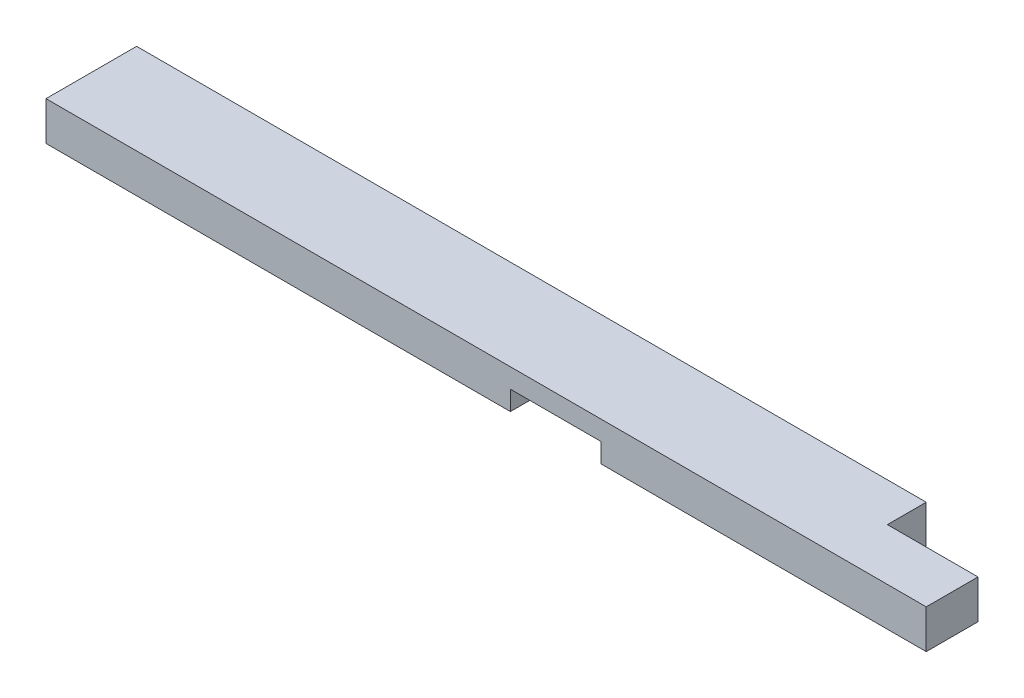
ISO-10303-21;
HEADER;
FILE_DESCRIPTION(('STEP AP214'),'2;1');
FILE_NAME('part.step','',(''),(''),'','','');
FILE_SCHEMA(('AUTOMOTIVE_DESIGN { 1 0 10303 214 1 1 1 1 }'));
ENDSEC;
DATA;
#1=APPLICATION_CONTEXT('core data for automotive mechanical design processes');
#2=APPLICATION_PROTOCOL_DEFINITION('international standard','automotive_design',2000,#1);
#3=PRODUCT_CONTEXT('',#1,'mechanical');
#4=PRODUCT('Part','Part','',(#3));
#5=PRODUCT_RELATED_PRODUCT_CATEGORY('part','',(#4));
#6=PRODUCT_DEFINITION_FORMATION('','',#4);
#7=PRODUCT_DEFINITION_CONTEXT('part definition',#1,'design');
#8=PRODUCT_DEFINITION('design','',#6,#7);
#9=PRODUCT_DEFINITION_SHAPE('','',#8);
#10=(LENGTH_UNIT() NAMED_UNIT(*) SI_UNIT(.MILLI.,.METRE.));
#11=(NAMED_UNIT(*) PLANE_ANGLE_UNIT() SI_UNIT($,.RADIAN.));
#12=(NAMED_UNIT(*) SI_UNIT($,.STERADIAN.) SOLID_ANGLE_UNIT());
#13=UNCERTAINTY_MEASURE_WITH_UNIT(LENGTH_MEASURE(1.E-05),#10,'distance_accuracy_value','');
#14=(GEOMETRIC_REPRESENTATION_CONTEXT(3) GLOBAL_UNCERTAINTY_ASSIGNED_CONTEXT((#13)) GLOBAL_UNIT_ASSIGNED_CONTEXT((#10,
#11,#12)) REPRESENTATION_CONTEXT('',''));
#15=CARTESIAN_POINT('',(0.,0.,0.));
#16=DIRECTION('',(0.,0.,1.));
#17=DIRECTION('',(1.,0.,0.));
#18=AXIS2_PLACEMENT_3D('',#15,#16,#17);
#19=CARTESIAN_POINT('',(0.,0.,0.));
#20=DIRECTION('',(0.,-1.,0.));
#21=DIRECTION('',(0.,0.,-1.));
#22=AXIS2_PLACEMENT_3D('',#19,#20,#21);
#23=PLANE('',#22);
#24=DIRECTION('',(0.,0.,-1.));
#25=VECTOR('',#24,1.);
#26=CARTESIAN_POINT('',(544.5125,0.,0.));
#27=LINE('',#26,#25);
#28=CARTESIAN_POINT('',(544.5125,0.,0.));
#29=VERTEX_POINT('',#28);
#30=CARTESIAN_POINT('',(544.5125,0.,-88.9));
#31=VERTEX_POINT('',#30);
#32=EDGE_CURVE('E115',#29,#31,#27,.T.);
#33=ORIENTED_EDGE('',*,*,#32,.T.);
#34=DIRECTION('',(-1.,0.,0.));
#35=VECTOR('',#34,1.);
#36=CARTESIAN_POINT('',(0.,0.,-88.9));
#37=LINE('',#36,#35);
#38=CARTESIAN_POINT('',(774.7,0.,-88.9));
#39=VERTEX_POINT('',#38);
#40=EDGE_CURVE('E151',#39,#31,#37,.T.);
#41=ORIENTED_EDGE('',*,*,#40,.F.);
#42=DIRECTION('',(0.,0.,1.));
#43=VECTOR('',#42,1.);
#44=CARTESIAN_POINT('',(774.7,0.,-88.9));
#45=LINE('',#44,#43);
#46=CARTESIAN_POINT('',(774.7,0.,-50.8));
#47=VERTEX_POINT('',#46);
#48=EDGE_CURVE('E194',#39,#47,#45,.T.);
#49=ORIENTED_EDGE('',*,*,#48,.T.);
#50=DIRECTION('',(1.,0.,0.));
#51=VECTOR('',#50,1.);
#52=CARTESIAN_POINT('',(863.6,0.,-50.8));
#53=LINE('',#52,#51);
#54=CARTESIAN_POINT('',(863.6,0.,-50.8));
#55=VERTEX_POINT('',#54);
#56=EDGE_CURVE('E61',#47,#55,#53,.T.);
#57=ORIENTED_EDGE('',*,*,#56,.T.);
#58=DIRECTION('',(0.,0.,-1.));
#59=VECTOR('',#58,1.);
#60=CARTESIAN_POINT('',(863.6,0.,0.));
#61=LINE('',#60,#59);
#62=CARTESIAN_POINT('',(863.6,0.,0.));
#63=VERTEX_POINT('',#62);
#64=EDGE_CURVE('E139',#63,#55,#61,.T.);
#65=ORIENTED_EDGE('',*,*,#64,.F.);
#66=DIRECTION('',(1.,0.,0.));
#67=VECTOR('',#66,1.);
#68=CARTESIAN_POINT('',(0.,0.,0.));
#69=LINE('',#68,#67);
#70=EDGE_CURVE('E132',#29,#63,#69,.T.);
#71=ORIENTED_EDGE('',*,*,#70,.F.);
#72=EDGE_LOOP('',(#33,#41,#49,#57,#65,#71));
#73=FACE_BOUND('',#72,.T.);
#74=ADVANCED_FACE('F38',(#73),#23,.T.);
#75=CARTESIAN_POINT('',(0.,38.1,0.));
#76=DIRECTION('',(1.,0.,0.));
#77=DIRECTION('',(0.,0.,-1.));
#78=AXIS2_PLACEMENT_3D('',#75,#76,#77);
#79=PLANE('',#78);
#80=DIRECTION('',(0.,0.,1.));
#81=VECTOR('',#80,1.);
#82=CARTESIAN_POINT('',(0.,0.,0.));
#83=LINE('',#82,#81);
#84=CARTESIAN_POINT('',(0.,0.,-88.9));
#85=VERTEX_POINT('',#84);
#86=CARTESIAN_POINT('',(0.,0.,0.));
#87=VERTEX_POINT('',#86);
#88=EDGE_CURVE('E141',#85,#87,#83,.T.);
#89=ORIENTED_EDGE('',*,*,#88,.T.);
#90=DIRECTION('',(0.,-1.,0.));
#91=VECTOR('',#90,1.);
#92=CARTESIAN_POINT('',(0.,38.1,0.));
#93=LINE('',#92,#91);
#94=CARTESIAN_POINT('',(0.,38.1,0.));
#95=VERTEX_POINT('',#94);
#96=EDGE_CURVE('E11',#95,#87,#93,.T.);
#97=ORIENTED_EDGE('',*,*,#96,.F.);
#98=DIRECTION('',(0.,0.,1.));
#99=VECTOR('',#98,1.);
#100=CARTESIAN_POINT('',(0.,38.1,0.));
#101=LINE('',#100,#99);
#102=CARTESIAN_POINT('',(0.,38.1,-88.9));
#103=VERTEX_POINT('',#102);
#104=EDGE_CURVE('E153',#103,#95,#101,.T.);
#105=ORIENTED_EDGE('',*,*,#104,.F.);
#106=DIRECTION('',(0.,-1.,0.));
#107=VECTOR('',#106,1.);
#108=CARTESIAN_POINT('',(0.,38.1,-88.9));
#109=LINE('',#108,#107);
#110=EDGE_CURVE('E154',#103,#85,#109,.T.);
#111=ORIENTED_EDGE('',*,*,#110,.T.);
#112=EDGE_LOOP('',(#89,#97,#105,#111));
#113=FACE_BOUND('',#112,.T.);
#114=ADVANCED_FACE('F40',(#113),#79,.F.);
#115=CARTESIAN_POINT('',(0.,38.1,0.));
#116=DIRECTION('',(0.,0.,-1.));
#117=DIRECTION('',(-1.,0.,0.));
#118=AXIS2_PLACEMENT_3D('',#115,#116,#117);
#119=PLANE('',#118);
#120=DIRECTION('',(1.,0.,0.));
#121=VECTOR('',#120,1.);
#122=CARTESIAN_POINT('',(544.5125,19.0499999999991,0.));
#123=LINE('',#122,#121);
#124=CARTESIAN_POINT('',(455.6125,19.0499999999991,0.));
#125=VERTEX_POINT('',#124);
#126=CARTESIAN_POINT('',(544.5125,19.0499999999991,0.));
#127=VERTEX_POINT('',#126);
#128=EDGE_CURVE('E127',#125,#127,#123,.T.);
#129=ORIENTED_EDGE('',*,*,#128,.T.);
#130=DIRECTION('',(0.,-1.,0.));
#131=VECTOR('',#130,1.);
#132=CARTESIAN_POINT('',(544.5125,19.0499999999991,0.));
#133=LINE('',#132,#131);
#134=EDGE_CURVE('E118',#127,#29,#133,.T.);
#135=ORIENTED_EDGE('',*,*,#134,.T.);
#136=ORIENTED_EDGE('',*,*,#70,.T.);
#137=DIRECTION('',(0.,-1.,0.));
#138=VECTOR('',#137,1.);
#139=CARTESIAN_POINT('',(863.6,38.1,0.));
#140=LINE('',#139,#138);
#141=CARTESIAN_POINT('',(863.6,38.1,0.));
#142=VERTEX_POINT('',#141);
#143=EDGE_CURVE('E46',#142,#63,#140,.T.);
#144=ORIENTED_EDGE('',*,*,#143,.F.);
#145=DIRECTION('',(1.,0.,0.));
#146=VECTOR('',#145,1.);
#147=CARTESIAN_POINT('',(0.,38.1,0.));
#148=LINE('',#147,#146);
#149=EDGE_CURVE('E163',#95,#142,#148,.T.);
#150=ORIENTED_EDGE('',*,*,#149,.F.);
#151=ORIENTED_EDGE('',*,*,#96,.T.);
#152=CARTESIAN_POINT('',(455.6125,0.,0.));
#153=VERTEX_POINT('',#152);
#154=EDGE_CURVE('E140',#87,#153,#69,.T.);
#155=ORIENTED_EDGE('',*,*,#154,.T.);
#156=DIRECTION('',(0.,1.,0.));
#157=VECTOR('',#156,1.);
#158=CARTESIAN_POINT('',(455.6125,19.0499999999991,0.));
#159=LINE('',#158,#157);
#160=EDGE_CURVE('E53',#153,#125,#159,.T.);
#161=ORIENTED_EDGE('',*,*,#160,.T.);
#162=EDGE_LOOP('',(#129,#135,#136,#144,#150,#151,#155,#161));
#163=FACE_BOUND('',#162,.T.);
#164=ADVANCED_FACE('F130',(#163),#119,.F.);
#165=CARTESIAN_POINT('',(863.6,38.1,0.));
#166=DIRECTION('',(-1.,0.,0.));
#167=DIRECTION('',(0.,0.,1.));
#168=AXIS2_PLACEMENT_3D('',#165,#166,#167);
#169=PLANE('',#168);
#170=ORIENTED_EDGE('',*,*,#64,.T.);
#171=DIRECTION('',(0.,1.,0.));
#172=VECTOR('',#171,1.);
#173=CARTESIAN_POINT('',(863.6,0.,-50.8));
#174=LINE('',#173,#172);
#175=CARTESIAN_POINT('',(863.6,38.1,-50.8));
#176=VERTEX_POINT('',#175);
#177=EDGE_CURVE('E145',#55,#176,#174,.T.);
#178=ORIENTED_EDGE('',*,*,#177,.T.);
#179=DIRECTION('',(0.,0.,-1.));
#180=VECTOR('',#179,1.);
#181=CARTESIAN_POINT('',(863.6,38.1,0.));
#182=LINE('',#181,#180);
#183=EDGE_CURVE('E162',#142,#176,#182,.T.);
#184=ORIENTED_EDGE('',*,*,#183,.F.);
#185=ORIENTED_EDGE('',*,*,#143,.T.);
#186=EDGE_LOOP('',(#170,#178,#184,#185));
#187=FACE_BOUND('',#186,.T.);
#188=ADVANCED_FACE('F159',(#187),#169,.F.);
#189=CARTESIAN_POINT('',(0.,38.1,-88.9));
#190=DIRECTION('',(0.,0.,1.));
#191=DIRECTION('',(1.,0.,0.));
#192=AXIS2_PLACEMENT_3D('',#189,#190,#191);
#193=PLANE('',#192);
#194=ORIENTED_EDGE('',*,*,#40,.T.);
#195=DIRECTION('',(0.,-1.,0.));
#196=VECTOR('',#195,1.);
#197=CARTESIAN_POINT('',(544.5125,19.0499999999991,-88.9));
#198=LINE('',#197,#196);
#199=CARTESIAN_POINT('',(544.5125,19.0499999999991,-88.9));
#200=VERTEX_POINT('',#199);
#201=EDGE_CURVE('E121',#200,#31,#198,.T.);
#202=ORIENTED_EDGE('',*,*,#201,.F.);
#203=DIRECTION('',(1.,0.,0.));
#204=VECTOR('',#203,1.);
#205=CARTESIAN_POINT('',(544.5125,19.0499999999991,-88.9));
#206=LINE('',#205,#204);
#207=CARTESIAN_POINT('',(455.6125,19.0499999999991,-88.9));
#208=VERTEX_POINT('',#207);
#209=EDGE_CURVE('E135',#208,#200,#206,.T.);
#210=ORIENTED_EDGE('',*,*,#209,.F.);
#211=DIRECTION('',(0.,1.,0.));
#212=VECTOR('',#211,1.);
#213=CARTESIAN_POINT('',(455.6125,19.0499999999991,-88.9));
#214=LINE('',#213,#212);
#215=CARTESIAN_POINT('',(455.6125,0.,-88.9));
#216=VERTEX_POINT('',#215);
#217=EDGE_CURVE('E183',#216,#208,#214,.T.);
#218=ORIENTED_EDGE('',*,*,#217,.F.);
#219=EDGE_CURVE('E150',#216,#85,#37,.T.);
#220=ORIENTED_EDGE('',*,*,#219,.T.);
#221=ORIENTED_EDGE('',*,*,#110,.F.);
#222=DIRECTION('',(-1.,0.,0.));
#223=VECTOR('',#222,1.);
#224=CARTESIAN_POINT('',(0.,38.1,-88.9));
#225=LINE('',#224,#223);
#226=CARTESIAN_POINT('',(774.7,38.1,-88.9));
#227=VERTEX_POINT('',#226);
#228=EDGE_CURVE('E156',#227,#103,#225,.T.);
#229=ORIENTED_EDGE('',*,*,#228,.F.);
#230=DIRECTION('',(0.,1.,0.));
#231=VECTOR('',#230,1.);
#232=CARTESIAN_POINT('',(774.7,0.,-88.9));
#233=LINE('',#232,#231);
#234=EDGE_CURVE('E199',#39,#227,#233,.T.);
#235=ORIENTED_EDGE('',*,*,#234,.F.);
#236=EDGE_LOOP('',(#194,#202,#210,#218,#220,#221,#229,#235));
#237=FACE_BOUND('',#236,.T.);
#238=ADVANCED_FACE('F213',(#237),#193,.F.);
#239=CARTESIAN_POINT('',(0.,38.1,0.));
#240=DIRECTION('',(0.,-1.,0.));
#241=DIRECTION('',(0.,0.,-1.));
#242=AXIS2_PLACEMENT_3D('',#239,#240,#241);
#243=PLANE('',#242);
#244=ORIENTED_EDGE('',*,*,#183,.T.);
#245=DIRECTION('',(1.,0.,0.));
#246=VECTOR('',#245,1.);
#247=CARTESIAN_POINT('',(863.6,38.1,-50.8));
#248=LINE('',#247,#246);
#249=CARTESIAN_POINT('',(774.7,38.1,-50.8));
#250=VERTEX_POINT('',#249);
#251=EDGE_CURVE('E197',#250,#176,#248,.T.);
#252=ORIENTED_EDGE('',*,*,#251,.F.);
#253=DIRECTION('',(0.,0.,1.));
#254=VECTOR('',#253,1.);
#255=CARTESIAN_POINT('',(774.7,38.1,-88.9));
#256=LINE('',#255,#254);
#257=EDGE_CURVE('E190',#227,#250,#256,.T.);
#258=ORIENTED_EDGE('',*,*,#257,.F.);
#259=ORIENTED_EDGE('',*,*,#228,.T.);
#260=ORIENTED_EDGE('',*,*,#104,.T.);
#261=ORIENTED_EDGE('',*,*,#149,.T.);
#262=EDGE_LOOP('',(#244,#252,#258,#259,#260,#261));
#263=FACE_BOUND('',#262,.T.);
#264=ADVANCED_FACE('F169',(#263),#243,.F.);
#265=DIRECTION('',(0.,0.,-1.));
#266=VECTOR('',#265,1.);
#267=CARTESIAN_POINT('',(455.6125,0.,0.));
#268=LINE('',#267,#266);
#269=EDGE_CURVE('E126',#153,#216,#268,.T.);
#270=ORIENTED_EDGE('',*,*,#269,.F.);
#271=ORIENTED_EDGE('',*,*,#154,.F.);
#272=ORIENTED_EDGE('',*,*,#88,.F.);
#273=ORIENTED_EDGE('',*,*,#219,.F.);
#274=EDGE_LOOP('',(#270,#271,#272,#273));
#275=FACE_BOUND('',#274,.T.);
#276=ADVANCED_FACE('F178',(#275),#23,.T.);
#277=CARTESIAN_POINT('',(863.6,0.,-50.8));
#278=DIRECTION('',(0.,0.,1.));
#279=DIRECTION('',(1.,0.,0.));
#280=AXIS2_PLACEMENT_3D('',#277,#278,#279);
#281=PLANE('',#280);
#282=ORIENTED_EDGE('',*,*,#251,.T.);
#283=ORIENTED_EDGE('',*,*,#177,.F.);
#284=ORIENTED_EDGE('',*,*,#56,.F.);
#285=DIRECTION('',(0.,1.,0.));
#286=VECTOR('',#285,1.);
#287=CARTESIAN_POINT('',(774.7,0.,-50.8));
#288=LINE('',#287,#286);
#289=EDGE_CURVE('E204',#47,#250,#288,.T.);
#290=ORIENTED_EDGE('',*,*,#289,.T.);
#291=EDGE_LOOP('',(#282,#283,#284,#290));
#292=FACE_BOUND('',#291,.T.);
#293=ADVANCED_FACE('F208',(#292),#281,.F.);
#294=CARTESIAN_POINT('',(774.7,0.,-88.9));
#295=DIRECTION('',(-1.,0.,0.));
#296=DIRECTION('',(0.,0.,1.));
#297=AXIS2_PLACEMENT_3D('',#294,#295,#296);
#298=PLANE('',#297);
#299=ORIENTED_EDGE('',*,*,#257,.T.);
#300=ORIENTED_EDGE('',*,*,#289,.F.);
#301=ORIENTED_EDGE('',*,*,#48,.F.);
#302=ORIENTED_EDGE('',*,*,#234,.T.);
#303=EDGE_LOOP('',(#299,#300,#301,#302));
#304=FACE_BOUND('',#303,.T.);
#305=ADVANCED_FACE('F210',(#304),#298,.F.);
#306=CARTESIAN_POINT('',(544.5125,19.0499999999991,0.));
#307=DIRECTION('',(1.,0.,0.));
#308=DIRECTION('',(0.,0.,-1.));
#309=AXIS2_PLACEMENT_3D('',#306,#307,#308);
#310=PLANE('',#309);
#311=ORIENTED_EDGE('',*,*,#201,.T.);
#312=ORIENTED_EDGE('',*,*,#32,.F.);
#313=ORIENTED_EDGE('',*,*,#134,.F.);
#314=DIRECTION('',(0.,0.,-1.));
#315=VECTOR('',#314,1.);
#316=CARTESIAN_POINT('',(544.5125,19.0499999999991,0.));
#317=LINE('',#316,#315);
#318=EDGE_CURVE('E188',#127,#200,#317,.T.);
#319=ORIENTED_EDGE('',*,*,#318,.T.);
#320=EDGE_LOOP('',(#311,#312,#313,#319));
#321=FACE_BOUND('',#320,.T.);
#322=ADVANCED_FACE('F117',(#321),#310,.F.);
#323=CARTESIAN_POINT('',(544.5125,19.0499999999991,0.));
#324=DIRECTION('',(0.,1.,0.));
#325=DIRECTION('',(-1.,0.,0.));
#326=AXIS2_PLACEMENT_3D('',#323,#324,#325);
#327=PLANE('',#326);
#328=ORIENTED_EDGE('',*,*,#209,.T.);
#329=ORIENTED_EDGE('',*,*,#318,.F.);
#330=ORIENTED_EDGE('',*,*,#128,.F.);
#331=DIRECTION('',(0.,0.,-1.));
#332=VECTOR('',#331,1.);
#333=CARTESIAN_POINT('',(455.6125,19.0499999999991,0.));
#334=LINE('',#333,#332);
#335=EDGE_CURVE('E191',#125,#208,#334,.T.);
#336=ORIENTED_EDGE('',*,*,#335,.T.);
#337=EDGE_LOOP('',(#328,#329,#330,#336));
#338=FACE_BOUND('',#337,.T.);
#339=ADVANCED_FACE('F218',(#338),#327,.F.);
#340=CARTESIAN_POINT('',(455.6125,19.0499999999991,0.));
#341=DIRECTION('',(-1.,0.,0.));
#342=DIRECTION('',(0.,0.,1.));
#343=AXIS2_PLACEMENT_3D('',#340,#341,#342);
#344=PLANE('',#343);
#345=ORIENTED_EDGE('',*,*,#217,.T.);
#346=ORIENTED_EDGE('',*,*,#335,.F.);
#347=ORIENTED_EDGE('',*,*,#160,.F.);
#348=ORIENTED_EDGE('',*,*,#269,.T.);
#349=EDGE_LOOP('',(#345,#346,#347,#348));
#350=FACE_BOUND('',#349,.T.);
#351=ADVANCED_FACE('F216',(#350),#344,.F.);
#352=CLOSED_SHELL('',(#74,#114,#164,#188,#238,#264,#276,#293,#305,#322,#339,#351));
#353=MANIFOLD_SOLID_BREP('B2',#352);
#354=ADVANCED_BREP_SHAPE_REPRESENTATION('',(#18,#353),#14);
#355=SHAPE_DEFINITION_REPRESENTATION(#9,#354);
ENDSEC;
END-ISO-10303-21;
